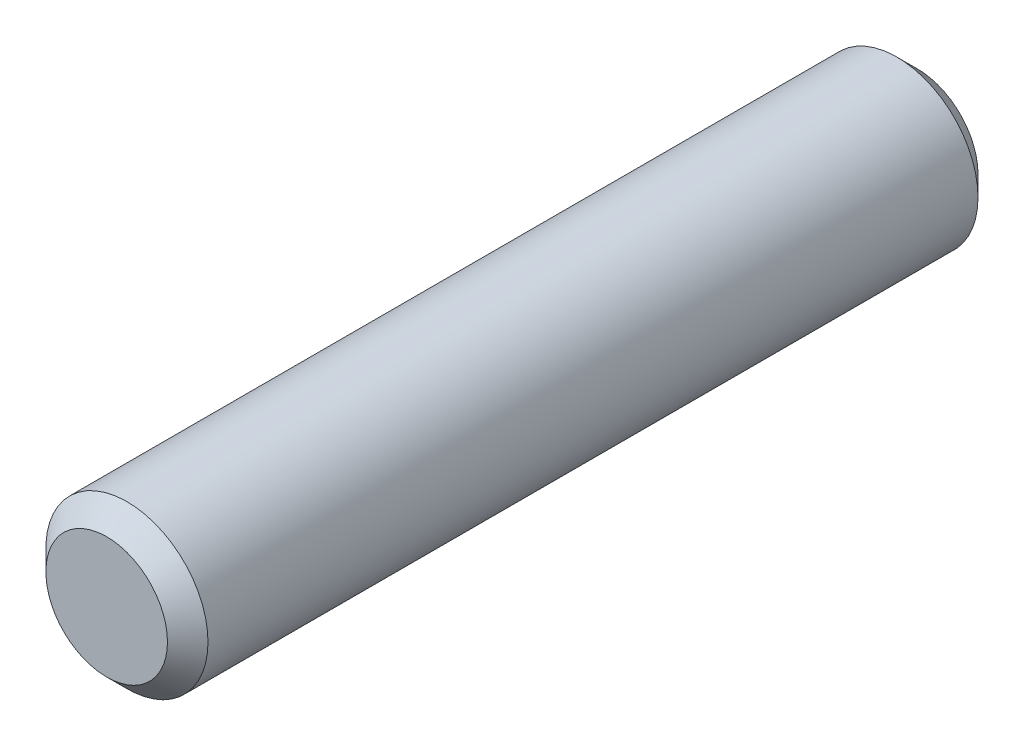
ISO-10303-21;
HEADER;
FILE_DESCRIPTION(('STEP AP214'),'2;1');
FILE_NAME('part.step','',(''),(''),'','','');
FILE_SCHEMA(('AUTOMOTIVE_DESIGN { 1 0 10303 214 1 1 1 1 }'));
ENDSEC;
DATA;
#1=APPLICATION_CONTEXT('core data for automotive mechanical design processes');
#2=APPLICATION_PROTOCOL_DEFINITION('international standard','automotive_design',2000,#1);
#3=PRODUCT_CONTEXT('',#1,'mechanical');
#4=PRODUCT('Part','Part','',(#3));
#5=PRODUCT_RELATED_PRODUCT_CATEGORY('part','',(#4));
#6=PRODUCT_DEFINITION_FORMATION('','',#4);
#7=PRODUCT_DEFINITION_CONTEXT('part definition',#1,'design');
#8=PRODUCT_DEFINITION('design','',#6,#7);
#9=PRODUCT_DEFINITION_SHAPE('','',#8);
#10=(LENGTH_UNIT() NAMED_UNIT(*) SI_UNIT(.MILLI.,.METRE.));
#11=(NAMED_UNIT(*) PLANE_ANGLE_UNIT() SI_UNIT($,.RADIAN.));
#12=(NAMED_UNIT(*) SI_UNIT($,.STERADIAN.) SOLID_ANGLE_UNIT());
#13=UNCERTAINTY_MEASURE_WITH_UNIT(LENGTH_MEASURE(1.E-05),#10,'distance_accuracy_value','');
#14=(GEOMETRIC_REPRESENTATION_CONTEXT(3) GLOBAL_UNCERTAINTY_ASSIGNED_CONTEXT((#13)) GLOBAL_UNIT_ASSIGNED_CONTEXT((#10,
#11,#12)) REPRESENTATION_CONTEXT('',''));
#15=CARTESIAN_POINT('',(0.,0.,0.));
#16=DIRECTION('',(0.,0.,1.));
#17=DIRECTION('',(1.,0.,0.));
#18=AXIS2_PLACEMENT_3D('',#15,#16,#17);
#19=CARTESIAN_POINT('',(0.,0.,9.99999999999998));
#20=DIRECTION('',(0.,0.,-1.));
#21=DIRECTION('',(-1.,0.,0.));
#22=AXIS2_PLACEMENT_3D('',#19,#20,#21);
#23=CYLINDRICAL_SURFACE('',#22,1.);
#24=CARTESIAN_POINT('',(0.,0.,9.74999999999998));
#25=DIRECTION('',(0.,0.,1.));
#26=DIRECTION('',(1.,0.,0.));
#27=AXIS2_PLACEMENT_3D('',#24,#25,#26);
#28=CIRCLE('',#27,1.);
#29=CARTESIAN_POINT('',(1.,0.,9.74999999999998));
#30=VERTEX_POINT('',#29);
#31=EDGE_CURVE('E35',#30,#30,#28,.F.);
#32=ORIENTED_EDGE('',*,*,#31,.T.);
#33=EDGE_LOOP('',(#32));
#34=FACE_BOUND('',#33,.T.);
#35=CARTESIAN_POINT('',(0.,0.,0.25));
#36=DIRECTION('',(0.,0.,1.));
#37=DIRECTION('',(1.,0.,0.));
#38=AXIS2_PLACEMENT_3D('',#35,#36,#37);
#39=CIRCLE('',#38,1.);
#40=CARTESIAN_POINT('',(1.,0.,0.25));
#41=VERTEX_POINT('',#40);
#42=EDGE_CURVE('E39',#41,#41,#39,.T.);
#43=ORIENTED_EDGE('',*,*,#42,.T.);
#44=EDGE_LOOP('',(#43));
#45=FACE_BOUND('',#44,.T.);
#46=ADVANCED_FACE('F29',(#34,#45),#23,.T.);
#47=CARTESIAN_POINT('',(0.,0.,9.99999999999998));
#48=DIRECTION('',(0.,0.,1.));
#49=DIRECTION('',(1.,0.,0.));
#50=AXIS2_PLACEMENT_3D('',#47,#48,#49);
#51=PLANE('',#50);
#52=CARTESIAN_POINT('',(0.,0.,9.99999999999998));
#53=DIRECTION('',(0.,0.,1.));
#54=DIRECTION('',(1.,0.,0.));
#55=AXIS2_PLACEMENT_3D('',#52,#53,#54);
#56=CIRCLE('',#55,0.749999999999998);
#57=CARTESIAN_POINT('',(0.749999999999998,0.,9.99999999999998));
#58=VERTEX_POINT('',#57);
#59=EDGE_CURVE('E43',#58,#58,#56,.T.);
#60=ORIENTED_EDGE('',*,*,#59,.T.);
#61=EDGE_LOOP('',(#60));
#62=FACE_BOUND('',#61,.T.);
#63=ADVANCED_FACE('F49',(#62),#51,.T.);
#64=CARTESIAN_POINT('',(0.,0.,0.));
#65=DIRECTION('',(0.,0.,1.));
#66=DIRECTION('',(1.,0.,0.));
#67=AXIS2_PLACEMENT_3D('',#64,#65,#66);
#68=PLANE('',#67);
#69=CARTESIAN_POINT('',(0.,0.,0.));
#70=DIRECTION('',(0.,0.,1.));
#71=DIRECTION('',(1.,0.,0.));
#72=AXIS2_PLACEMENT_3D('',#69,#70,#71);
#73=CIRCLE('',#72,0.749999999999998);
#74=CARTESIAN_POINT('',(0.749999999999998,0.,0.));
#75=VERTEX_POINT('',#74);
#76=EDGE_CURVE('E10',#75,#75,#73,.F.);
#77=ORIENTED_EDGE('',*,*,#76,.T.);
#78=EDGE_LOOP('',(#77));
#79=FACE_BOUND('',#78,.T.);
#80=ADVANCED_FACE('F54',(#79),#68,.F.);
#81=CARTESIAN_POINT('',(0.,0.,9.99999999999998));
#82=DIRECTION('',(0.,0.,-1.));
#83=DIRECTION('',(-1.,0.,0.));
#84=AXIS2_PLACEMENT_3D('',#81,#82,#83);
#85=CONICAL_SURFACE('',#84,0.749999999999998,0.785398163397445);
#86=ORIENTED_EDGE('',*,*,#31,.F.);
#87=EDGE_LOOP('',(#86));
#88=FACE_BOUND('',#87,.T.);
#89=ORIENTED_EDGE('',*,*,#59,.F.);
#90=EDGE_LOOP('',(#89));
#91=FACE_BOUND('',#90,.T.);
#92=ADVANCED_FACE('F51',(#88,#91),#85,.T.);
#93=CARTESIAN_POINT('',(0.,0.,0.25));
#94=DIRECTION('',(0.,0.,1.));
#95=DIRECTION('',(1.,0.,0.));
#96=AXIS2_PLACEMENT_3D('',#93,#94,#95);
#97=CONICAL_SURFACE('',#96,1.,0.785398163397443);
#98=ORIENTED_EDGE('',*,*,#76,.F.);
#99=EDGE_LOOP('',(#98));
#100=FACE_BOUND('',#99,.T.);
#101=ORIENTED_EDGE('',*,*,#42,.F.);
#102=EDGE_LOOP('',(#101));
#103=FACE_BOUND('',#102,.T.);
#104=ADVANCED_FACE('F53',(#100,#103),#97,.T.);
#105=CLOSED_SHELL('',(#46,#63,#80,#92,#104));
#106=MANIFOLD_SOLID_BREP('B2',#105);
#107=ADVANCED_BREP_SHAPE_REPRESENTATION('',(#18,#106),#14);
#108=SHAPE_DEFINITION_REPRESENTATION(#9,#107);
ENDSEC;
END-ISO-10303-21;
